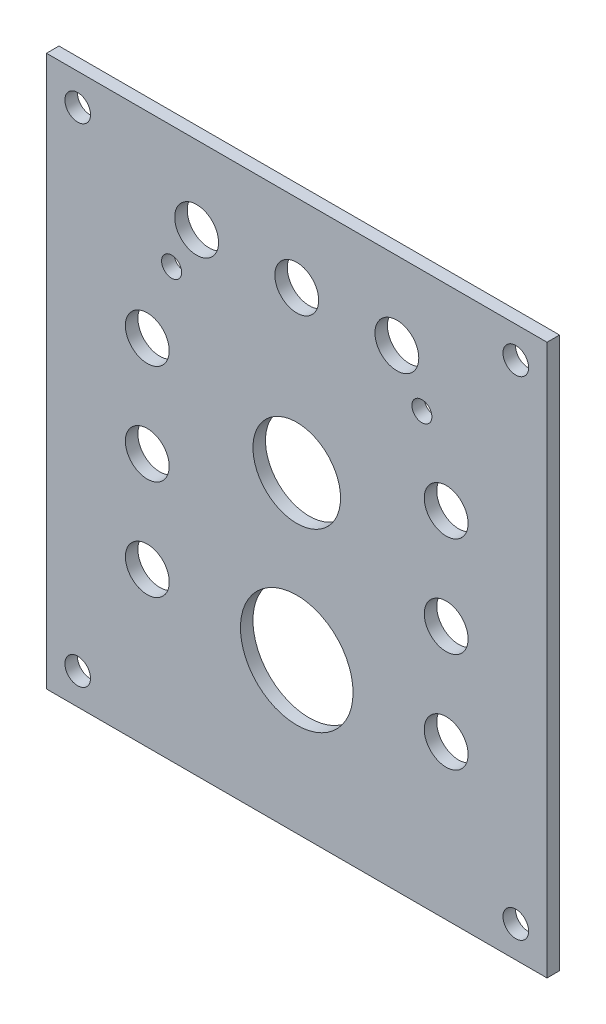
ISO-10303-21;
HEADER;
FILE_DESCRIPTION(('STEP AP214'),'2;1');
FILE_NAME('part.step','',(''),(''),'','','');
FILE_SCHEMA(('AUTOMOTIVE_DESIGN { 1 0 10303 214 1 1 1 1 }'));
ENDSEC;
DATA;
#1=APPLICATION_CONTEXT('core data for automotive mechanical design processes');
#2=APPLICATION_PROTOCOL_DEFINITION('international standard','automotive_design',2000,#1);
#3=PRODUCT_CONTEXT('',#1,'mechanical');
#4=PRODUCT('Part','Part','',(#3));
#5=PRODUCT_RELATED_PRODUCT_CATEGORY('part','',(#4));
#6=PRODUCT_DEFINITION_FORMATION('','',#4);
#7=PRODUCT_DEFINITION_CONTEXT('part definition',#1,'design');
#8=PRODUCT_DEFINITION('design','',#6,#7);
#9=PRODUCT_DEFINITION_SHAPE('','',#8);
#10=(LENGTH_UNIT() NAMED_UNIT(*) SI_UNIT(.MILLI.,.METRE.));
#11=(NAMED_UNIT(*) PLANE_ANGLE_UNIT() SI_UNIT($,.RADIAN.));
#12=(NAMED_UNIT(*) SI_UNIT($,.STERADIAN.) SOLID_ANGLE_UNIT());
#13=UNCERTAINTY_MEASURE_WITH_UNIT(LENGTH_MEASURE(1.E-05),#10,'distance_accuracy_value','');
#14=(GEOMETRIC_REPRESENTATION_CONTEXT(3) GLOBAL_UNCERTAINTY_ASSIGNED_CONTEXT((#13)) GLOBAL_UNIT_ASSIGNED_CONTEXT((#10,
#11,#12)) REPRESENTATION_CONTEXT('',''));
#15=CARTESIAN_POINT('',(0.,0.,0.));
#16=DIRECTION('',(0.,0.,1.));
#17=DIRECTION('',(1.,0.,0.));
#18=AXIS2_PLACEMENT_3D('',#15,#16,#17);
#19=CARTESIAN_POINT('',(63.5,101.6,0.));
#20=DIRECTION('',(1.,0.,0.));
#21=DIRECTION('',(0.,0.,-1.));
#22=AXIS2_PLACEMENT_3D('',#19,#20,#21);
#23=PLANE('',#22);
#24=DIRECTION('',(0.,-1.,0.));
#25=VECTOR('',#24,1.);
#26=CARTESIAN_POINT('',(63.5,101.6,-3.175));
#27=LINE('',#26,#25);
#28=CARTESIAN_POINT('',(63.5,101.6,-3.175));
#29=VERTEX_POINT('',#28);
#30=CARTESIAN_POINT('',(63.5,-38.1,-3.175));
#31=VERTEX_POINT('',#30);
#32=EDGE_CURVE('E98',#29,#31,#27,.T.);
#33=ORIENTED_EDGE('',*,*,#32,.F.);
#34=DIRECTION('',(0.,0.,-1.));
#35=VECTOR('',#34,1.);
#36=CARTESIAN_POINT('',(63.5,101.6,0.));
#37=LINE('',#36,#35);
#38=CARTESIAN_POINT('',(63.5,101.6,0.));
#39=VERTEX_POINT('',#38);
#40=EDGE_CURVE('E11',#39,#29,#37,.T.);
#41=ORIENTED_EDGE('',*,*,#40,.F.);
#42=DIRECTION('',(0.,-1.,0.));
#43=VECTOR('',#42,1.);
#44=CARTESIAN_POINT('',(63.5,101.6,0.));
#45=LINE('',#44,#43);
#46=CARTESIAN_POINT('',(63.5,-38.1,0.));
#47=VERTEX_POINT('',#46);
#48=EDGE_CURVE('E91',#39,#47,#45,.T.);
#49=ORIENTED_EDGE('',*,*,#48,.T.);
#50=DIRECTION('',(0.,0.,-1.));
#51=VECTOR('',#50,1.);
#52=CARTESIAN_POINT('',(63.5,-38.1,0.));
#53=LINE('',#52,#51);
#54=EDGE_CURVE('E36',#47,#31,#53,.T.);
#55=ORIENTED_EDGE('',*,*,#54,.T.);
#56=EDGE_LOOP('',(#33,#41,#49,#55));
#57=FACE_BOUND('',#56,.T.);
#58=ADVANCED_FACE('F33',(#57),#23,.T.);
#59=CARTESIAN_POINT('',(-63.5,101.6,0.));
#60=DIRECTION('',(0.,1.,0.));
#61=DIRECTION('',(0.,0.,1.));
#62=AXIS2_PLACEMENT_3D('',#59,#60,#61);
#63=PLANE('',#62);
#64=DIRECTION('',(1.,0.,0.));
#65=VECTOR('',#64,1.);
#66=CARTESIAN_POINT('',(-63.5,101.6,-3.175));
#67=LINE('',#66,#65);
#68=CARTESIAN_POINT('',(-63.5,101.6,-3.175));
#69=VERTEX_POINT('',#68);
#70=EDGE_CURVE('E93',#69,#29,#67,.T.);
#71=ORIENTED_EDGE('',*,*,#70,.F.);
#72=DIRECTION('',(0.,0.,-1.));
#73=VECTOR('',#72,1.);
#74=CARTESIAN_POINT('',(-63.5,101.6,0.));
#75=LINE('',#74,#73);
#76=CARTESIAN_POINT('',(-63.5,101.6,0.));
#77=VERTEX_POINT('',#76);
#78=EDGE_CURVE('E42',#77,#69,#75,.T.);
#79=ORIENTED_EDGE('',*,*,#78,.F.);
#80=DIRECTION('',(1.,0.,0.));
#81=VECTOR('',#80,1.);
#82=CARTESIAN_POINT('',(-63.5,101.6,0.));
#83=LINE('',#82,#81);
#84=EDGE_CURVE('E88',#77,#39,#83,.T.);
#85=ORIENTED_EDGE('',*,*,#84,.T.);
#86=ORIENTED_EDGE('',*,*,#40,.T.);
#87=EDGE_LOOP('',(#71,#79,#85,#86));
#88=FACE_BOUND('',#87,.T.);
#89=ADVANCED_FACE('F109',(#88),#63,.T.);
#90=CARTESIAN_POINT('',(-63.5,-38.1,0.));
#91=DIRECTION('',(-1.,0.,0.));
#92=DIRECTION('',(0.,0.,1.));
#93=AXIS2_PLACEMENT_3D('',#90,#91,#92);
#94=PLANE('',#93);
#95=DIRECTION('',(0.,1.,0.));
#96=VECTOR('',#95,1.);
#97=CARTESIAN_POINT('',(-63.5,-38.1,-3.175));
#98=LINE('',#97,#96);
#99=CARTESIAN_POINT('',(-63.5,-38.1,-3.175));
#100=VERTEX_POINT('',#99);
#101=EDGE_CURVE('E83',#100,#69,#98,.T.);
#102=ORIENTED_EDGE('',*,*,#101,.F.);
#103=DIRECTION('',(0.,0.,-1.));
#104=VECTOR('',#103,1.);
#105=CARTESIAN_POINT('',(-63.5,-38.1,0.));
#106=LINE('',#105,#104);
#107=CARTESIAN_POINT('',(-63.5,-38.1,0.));
#108=VERTEX_POINT('',#107);
#109=EDGE_CURVE('E78',#108,#100,#106,.T.);
#110=ORIENTED_EDGE('',*,*,#109,.F.);
#111=DIRECTION('',(0.,1.,0.));
#112=VECTOR('',#111,1.);
#113=CARTESIAN_POINT('',(-63.5,-38.1,0.));
#114=LINE('',#113,#112);
#115=EDGE_CURVE('E81',#108,#77,#114,.T.);
#116=ORIENTED_EDGE('',*,*,#115,.T.);
#117=ORIENTED_EDGE('',*,*,#78,.T.);
#118=EDGE_LOOP('',(#102,#110,#116,#117));
#119=FACE_BOUND('',#118,.T.);
#120=ADVANCED_FACE('F80',(#119),#94,.T.);
#121=CARTESIAN_POINT('',(63.5,-38.1,0.));
#122=DIRECTION('',(0.,-1.,0.));
#123=DIRECTION('',(1.,0.,0.));
#124=AXIS2_PLACEMENT_3D('',#121,#122,#123);
#125=PLANE('',#124);
#126=DIRECTION('',(-1.,0.,0.));
#127=VECTOR('',#126,1.);
#128=CARTESIAN_POINT('',(63.5,-38.1,-3.175));
#129=LINE('',#128,#127);
#130=EDGE_CURVE('E101',#31,#100,#129,.T.);
#131=ORIENTED_EDGE('',*,*,#130,.F.);
#132=ORIENTED_EDGE('',*,*,#54,.F.);
#133=DIRECTION('',(-1.,0.,0.));
#134=VECTOR('',#133,1.);
#135=CARTESIAN_POINT('',(63.5,-38.1,0.));
#136=LINE('',#135,#134);
#137=EDGE_CURVE('E87',#47,#108,#136,.T.);
#138=ORIENTED_EDGE('',*,*,#137,.T.);
#139=ORIENTED_EDGE('',*,*,#109,.T.);
#140=EDGE_LOOP('',(#131,#132,#138,#139));
#141=FACE_BOUND('',#140,.T.);
#142=ADVANCED_FACE('F90',(#141),#125,.T.);
#143=CARTESIAN_POINT('',(0.,0.,0.));
#144=DIRECTION('',(0.,0.,-1.));
#145=DIRECTION('',(-1.,0.,0.));
#146=AXIS2_PLACEMENT_3D('',#143,#144,#145);
#147=PLANE('',#146);
#148=CARTESIAN_POINT('',(31.75,70.58025,0.));
#149=DIRECTION('',(0.,0.,-1.));
#150=DIRECTION('',(1.,0.,0.));
#151=AXIS2_PLACEMENT_3D('',#148,#149,#150);
#152=CIRCLE('',#151,2.54);
#153=CARTESIAN_POINT('',(34.29,70.58025,0.));
#154=VERTEX_POINT('',#153);
#155=EDGE_CURVE('E202',#154,#154,#152,.T.);
#156=ORIENTED_EDGE('',*,*,#155,.T.);
#157=EDGE_LOOP('',(#156));
#158=FACE_BOUND('',#157,.T.);
#159=CARTESIAN_POINT('',(-31.75,70.58025,0.));
#160=DIRECTION('',(0.,0.,-1.));
#161=DIRECTION('',(1.,0.,0.));
#162=AXIS2_PLACEMENT_3D('',#159,#160,#161);
#163=CIRCLE('',#162,2.54);
#164=CARTESIAN_POINT('',(-29.21,70.58025,0.));
#165=VERTEX_POINT('',#164);
#166=EDGE_CURVE('E210',#165,#165,#163,.T.);
#167=ORIENTED_EDGE('',*,*,#166,.T.);
#168=EDGE_LOOP('',(#167));
#169=FACE_BOUND('',#168,.T.);
#170=CARTESIAN_POINT('',(37.9152217386642,26.3771785892618,0.));
#171=DIRECTION('',(0.,0.,-1.));
#172=DIRECTION('',(1.,0.,0.));
#173=AXIS2_PLACEMENT_3D('',#170,#171,#172);
#174=CIRCLE('',#173,5.5626);
#175=CARTESIAN_POINT('',(43.4778217386642,26.3771785892618,0.));
#176=VERTEX_POINT('',#175);
#177=EDGE_CURVE('E216',#176,#176,#174,.T.);
#178=ORIENTED_EDGE('',*,*,#177,.T.);
#179=EDGE_LOOP('',(#178));
#180=FACE_BOUND('',#179,.T.);
#181=CARTESIAN_POINT('',(-37.9152217386642,26.3771785892618,0.));
#182=DIRECTION('',(0.,0.,-1.));
#183=DIRECTION('',(1.,0.,0.));
#184=AXIS2_PLACEMENT_3D('',#181,#182,#183);
#185=CIRCLE('',#184,5.5626);
#186=CARTESIAN_POINT('',(-32.3526217386642,26.3771785892618,0.));
#187=VERTEX_POINT('',#186);
#188=EDGE_CURVE('E222',#187,#187,#185,.T.);
#189=ORIENTED_EDGE('',*,*,#188,.T.);
#190=EDGE_LOOP('',(#189));
#191=FACE_BOUND('',#190,.T.);
#192=CARTESIAN_POINT('',(-37.9152217386642,0.977178589261808,0.));
#193=DIRECTION('',(0.,0.,-1.));
#194=DIRECTION('',(1.,0.,0.));
#195=AXIS2_PLACEMENT_3D('',#192,#193,#194);
#196=CIRCLE('',#195,5.5626);
#197=CARTESIAN_POINT('',(-32.3526217386642,0.977178589261808,0.));
#198=VERTEX_POINT('',#197);
#199=EDGE_CURVE('E228',#198,#198,#196,.T.);
#200=ORIENTED_EDGE('',*,*,#199,.T.);
#201=EDGE_LOOP('',(#200));
#202=FACE_BOUND('',#201,.T.);
#203=CARTESIAN_POINT('',(37.9152217386642,51.7771785892618,0.));
#204=DIRECTION('',(0.,0.,-1.));
#205=DIRECTION('',(1.,0.,0.));
#206=AXIS2_PLACEMENT_3D('',#203,#204,#205);
#207=CIRCLE('',#206,5.56260000000001);
#208=CARTESIAN_POINT('',(43.4778217386643,51.7771785892618,0.));
#209=VERTEX_POINT('',#208);
#210=EDGE_CURVE('E234',#209,#209,#207,.T.);
#211=ORIENTED_EDGE('',*,*,#210,.T.);
#212=EDGE_LOOP('',(#211));
#213=FACE_BOUND('',#212,.T.);
#214=CARTESIAN_POINT('',(-25.4,81.8388,0.));
#215=DIRECTION('',(0.,0.,-1.));
#216=DIRECTION('',(1.,0.,0.));
#217=AXIS2_PLACEMENT_3D('',#214,#215,#216);
#218=CIRCLE('',#217,5.5626);
#219=CARTESIAN_POINT('',(-19.8374,81.8388,0.));
#220=VERTEX_POINT('',#219);
#221=EDGE_CURVE('E240',#220,#220,#218,.T.);
#222=ORIENTED_EDGE('',*,*,#221,.T.);
#223=EDGE_LOOP('',(#222));
#224=FACE_BOUND('',#223,.T.);
#225=CARTESIAN_POINT('',(0.,0.,0.));
#226=DIRECTION('',(0.,0.,-1.));
#227=DIRECTION('',(1.,0.,0.));
#228=AXIS2_PLACEMENT_3D('',#225,#226,#227);
#229=CIRCLE('',#228,14.2875);
#230=CARTESIAN_POINT('',(14.2875,0.,0.));
#231=VERTEX_POINT('',#230);
#232=EDGE_CURVE('E246',#231,#231,#229,.T.);
#233=ORIENTED_EDGE('',*,*,#232,.T.);
#234=EDGE_LOOP('',(#233));
#235=FACE_BOUND('',#234,.T.);
#236=CARTESIAN_POINT('',(-55.5752,93.6752,0.));
#237=DIRECTION('',(0.,0.,-1.));
#238=DIRECTION('',(1.,0.,0.));
#239=AXIS2_PLACEMENT_3D('',#236,#237,#238);
#240=CIRCLE('',#239,3.2512);
#241=CARTESIAN_POINT('',(-52.324,93.6752,0.));
#242=VERTEX_POINT('',#241);
#243=EDGE_CURVE('E252',#242,#242,#240,.T.);
#244=ORIENTED_EDGE('',*,*,#243,.T.);
#245=EDGE_LOOP('',(#244));
#246=FACE_BOUND('',#245,.T.);
#247=CARTESIAN_POINT('',(55.5752,-30.1752,0.));
#248=DIRECTION('',(0.,0.,-1.));
#249=DIRECTION('',(1.,0.,0.));
#250=AXIS2_PLACEMENT_3D('',#247,#248,#249);
#251=CIRCLE('',#250,3.2512);
#252=CARTESIAN_POINT('',(58.8264,-30.1752,0.));
#253=VERTEX_POINT('',#252);
#254=EDGE_CURVE('E258',#253,#253,#251,.T.);
#255=ORIENTED_EDGE('',*,*,#254,.T.);
#256=EDGE_LOOP('',(#255));
#257=FACE_BOUND('',#256,.T.);
#258=CARTESIAN_POINT('',(55.5752,93.6752,0.));
#259=DIRECTION('',(0.,0.,-1.));
#260=DIRECTION('',(1.,0.,0.));
#261=AXIS2_PLACEMENT_3D('',#258,#259,#260);
#262=CIRCLE('',#261,3.25119999999999);
#263=CARTESIAN_POINT('',(58.8264,93.6752,0.));
#264=VERTEX_POINT('',#263);
#265=EDGE_CURVE('E264',#264,#264,#262,.T.);
#266=ORIENTED_EDGE('',*,*,#265,.T.);
#267=EDGE_LOOP('',(#266));
#268=FACE_BOUND('',#267,.T.);
#269=CARTESIAN_POINT('',(0.,41.148,0.));
#270=DIRECTION('',(0.,0.,-1.));
#271=DIRECTION('',(1.,0.,0.));
#272=AXIS2_PLACEMENT_3D('',#269,#270,#271);
#273=CIRCLE('',#272,11.1125);
#274=CARTESIAN_POINT('',(11.1125,41.148,0.));
#275=VERTEX_POINT('',#274);
#276=EDGE_CURVE('E270',#275,#275,#273,.T.);
#277=ORIENTED_EDGE('',*,*,#276,.T.);
#278=EDGE_LOOP('',(#277));
#279=FACE_BOUND('',#278,.T.);
#280=CARTESIAN_POINT('',(25.4,81.8388,0.));
#281=DIRECTION('',(0.,0.,-1.));
#282=DIRECTION('',(1.,0.,0.));
#283=AXIS2_PLACEMENT_3D('',#280,#281,#282);
#284=CIRCLE('',#283,5.5626);
#285=CARTESIAN_POINT('',(30.9626,81.8388,0.));
#286=VERTEX_POINT('',#285);
#287=EDGE_CURVE('E276',#286,#286,#284,.T.);
#288=ORIENTED_EDGE('',*,*,#287,.T.);
#289=EDGE_LOOP('',(#288));
#290=FACE_BOUND('',#289,.T.);
#291=CARTESIAN_POINT('',(37.9152217386642,0.977178589261784,0.));
#292=DIRECTION('',(0.,0.,-1.));
#293=DIRECTION('',(1.,0.,0.));
#294=AXIS2_PLACEMENT_3D('',#291,#292,#293);
#295=CIRCLE('',#294,5.5626);
#296=CARTESIAN_POINT('',(43.4778217386642,0.977178589261784,0.));
#297=VERTEX_POINT('',#296);
#298=EDGE_CURVE('E282',#297,#297,#295,.T.);
#299=ORIENTED_EDGE('',*,*,#298,.T.);
#300=EDGE_LOOP('',(#299));
#301=FACE_BOUND('',#300,.T.);
#302=CARTESIAN_POINT('',(-37.9152217386642,51.7771785892618,0.));
#303=DIRECTION('',(0.,0.,-1.));
#304=DIRECTION('',(1.,0.,0.));
#305=AXIS2_PLACEMENT_3D('',#302,#303,#304);
#306=CIRCLE('',#305,5.5626);
#307=CARTESIAN_POINT('',(-32.3526217386642,51.7771785892618,0.));
#308=VERTEX_POINT('',#307);
#309=EDGE_CURVE('E288',#308,#308,#306,.T.);
#310=ORIENTED_EDGE('',*,*,#309,.T.);
#311=EDGE_LOOP('',(#310));
#312=FACE_BOUND('',#311,.T.);
#313=CARTESIAN_POINT('',(0.,81.8388,0.));
#314=DIRECTION('',(0.,0.,-1.));
#315=DIRECTION('',(1.,0.,0.));
#316=AXIS2_PLACEMENT_3D('',#313,#314,#315);
#317=CIRCLE('',#316,5.5626);
#318=CARTESIAN_POINT('',(5.5626,81.8388,0.));
#319=VERTEX_POINT('',#318);
#320=EDGE_CURVE('E294',#319,#319,#317,.T.);
#321=ORIENTED_EDGE('',*,*,#320,.T.);
#322=EDGE_LOOP('',(#321));
#323=FACE_BOUND('',#322,.T.);
#324=CARTESIAN_POINT('',(-55.5752000000001,-30.1752,0.));
#325=DIRECTION('',(0.,0.,-1.));
#326=DIRECTION('',(1.,0.,0.));
#327=AXIS2_PLACEMENT_3D('',#324,#325,#326);
#328=CIRCLE('',#327,3.2512);
#329=CARTESIAN_POINT('',(-52.3240000000001,-30.1752,0.));
#330=VERTEX_POINT('',#329);
#331=EDGE_CURVE('E102',#330,#330,#328,.T.);
#332=ORIENTED_EDGE('',*,*,#331,.T.);
#333=EDGE_LOOP('',(#332));
#334=FACE_BOUND('',#333,.T.);
#335=ORIENTED_EDGE('',*,*,#48,.F.);
#336=ORIENTED_EDGE('',*,*,#84,.F.);
#337=ORIENTED_EDGE('',*,*,#115,.F.);
#338=ORIENTED_EDGE('',*,*,#137,.F.);
#339=EDGE_LOOP('',(#335,#336,#337,#338));
#340=FACE_BOUND('',#339,.T.);
#341=ADVANCED_FACE('F86',(#158,#169,#180,#191,#202,#213,#224,#235,#246,#257,#268,#279,#290,#301,
#312,#323,#334,#340),#147,.F.);
#342=CARTESIAN_POINT('',(0.,0.,-3.175));
#343=DIRECTION('',(0.,0.,-1.));
#344=DIRECTION('',(-1.,0.,0.));
#345=AXIS2_PLACEMENT_3D('',#342,#343,#344);
#346=PLANE('',#345);
#347=CARTESIAN_POINT('',(31.75,70.58025,-3.175));
#348=DIRECTION('',(0.,0.,-1.));
#349=DIRECTION('',(1.,0.,0.));
#350=AXIS2_PLACEMENT_3D('',#347,#348,#349);
#351=CIRCLE('',#350,2.54);
#352=CARTESIAN_POINT('',(34.29,70.58025,-3.175));
#353=VERTEX_POINT('',#352);
#354=EDGE_CURVE('E205',#353,#353,#351,.T.);
#355=ORIENTED_EDGE('',*,*,#354,.F.);
#356=EDGE_LOOP('',(#355));
#357=FACE_BOUND('',#356,.T.);
#358=CARTESIAN_POINT('',(-31.75,70.58025,-3.175));
#359=DIRECTION('',(0.,0.,-1.));
#360=DIRECTION('',(1.,0.,0.));
#361=AXIS2_PLACEMENT_3D('',#358,#359,#360);
#362=CIRCLE('',#361,2.54);
#363=CARTESIAN_POINT('',(-29.21,70.58025,-3.175));
#364=VERTEX_POINT('',#363);
#365=EDGE_CURVE('E207',#364,#364,#362,.T.);
#366=ORIENTED_EDGE('',*,*,#365,.F.);
#367=EDGE_LOOP('',(#366));
#368=FACE_BOUND('',#367,.T.);
#369=CARTESIAN_POINT('',(37.9152217386642,26.3771785892618,-3.175));
#370=DIRECTION('',(0.,0.,-1.));
#371=DIRECTION('',(1.,0.,0.));
#372=AXIS2_PLACEMENT_3D('',#369,#370,#371);
#373=CIRCLE('',#372,5.5626);
#374=CARTESIAN_POINT('',(43.4778217386642,26.3771785892618,-3.175));
#375=VERTEX_POINT('',#374);
#376=EDGE_CURVE('E213',#375,#375,#373,.T.);
#377=ORIENTED_EDGE('',*,*,#376,.F.);
#378=EDGE_LOOP('',(#377));
#379=FACE_BOUND('',#378,.T.);
#380=CARTESIAN_POINT('',(-37.9152217386642,26.3771785892618,-3.175));
#381=DIRECTION('',(0.,0.,-1.));
#382=DIRECTION('',(1.,0.,0.));
#383=AXIS2_PLACEMENT_3D('',#380,#381,#382);
#384=CIRCLE('',#383,5.5626);
#385=CARTESIAN_POINT('',(-32.3526217386642,26.3771785892618,-3.175));
#386=VERTEX_POINT('',#385);
#387=EDGE_CURVE('E219',#386,#386,#384,.T.);
#388=ORIENTED_EDGE('',*,*,#387,.F.);
#389=EDGE_LOOP('',(#388));
#390=FACE_BOUND('',#389,.T.);
#391=CARTESIAN_POINT('',(-37.9152217386642,0.977178589261808,-3.175));
#392=DIRECTION('',(0.,0.,-1.));
#393=DIRECTION('',(1.,0.,0.));
#394=AXIS2_PLACEMENT_3D('',#391,#392,#393);
#395=CIRCLE('',#394,5.5626);
#396=CARTESIAN_POINT('',(-32.3526217386642,0.977178589261808,-3.175));
#397=VERTEX_POINT('',#396);
#398=EDGE_CURVE('E225',#397,#397,#395,.T.);
#399=ORIENTED_EDGE('',*,*,#398,.F.);
#400=EDGE_LOOP('',(#399));
#401=FACE_BOUND('',#400,.T.);
#402=CARTESIAN_POINT('',(37.9152217386642,51.7771785892618,-3.175));
#403=DIRECTION('',(0.,0.,-1.));
#404=DIRECTION('',(1.,0.,0.));
#405=AXIS2_PLACEMENT_3D('',#402,#403,#404);
#406=CIRCLE('',#405,5.56260000000001);
#407=CARTESIAN_POINT('',(43.4778217386643,51.7771785892618,-3.175));
#408=VERTEX_POINT('',#407);
#409=EDGE_CURVE('E231',#408,#408,#406,.T.);
#410=ORIENTED_EDGE('',*,*,#409,.F.);
#411=EDGE_LOOP('',(#410));
#412=FACE_BOUND('',#411,.T.);
#413=CARTESIAN_POINT('',(-25.4,81.8388,-3.175));
#414=DIRECTION('',(0.,0.,-1.));
#415=DIRECTION('',(1.,0.,0.));
#416=AXIS2_PLACEMENT_3D('',#413,#414,#415);
#417=CIRCLE('',#416,5.5626);
#418=CARTESIAN_POINT('',(-19.8374,81.8388,-3.175));
#419=VERTEX_POINT('',#418);
#420=EDGE_CURVE('E237',#419,#419,#417,.T.);
#421=ORIENTED_EDGE('',*,*,#420,.F.);
#422=EDGE_LOOP('',(#421));
#423=FACE_BOUND('',#422,.T.);
#424=CARTESIAN_POINT('',(0.,0.,-3.175));
#425=DIRECTION('',(0.,0.,-1.));
#426=DIRECTION('',(1.,0.,0.));
#427=AXIS2_PLACEMENT_3D('',#424,#425,#426);
#428=CIRCLE('',#427,14.2875);
#429=CARTESIAN_POINT('',(14.2875,0.,-3.175));
#430=VERTEX_POINT('',#429);
#431=EDGE_CURVE('E243',#430,#430,#428,.T.);
#432=ORIENTED_EDGE('',*,*,#431,.F.);
#433=EDGE_LOOP('',(#432));
#434=FACE_BOUND('',#433,.T.);
#435=CARTESIAN_POINT('',(-55.5752,93.6752,-3.175));
#436=DIRECTION('',(0.,0.,-1.));
#437=DIRECTION('',(1.,0.,0.));
#438=AXIS2_PLACEMENT_3D('',#435,#436,#437);
#439=CIRCLE('',#438,3.2512);
#440=CARTESIAN_POINT('',(-52.324,93.6752,-3.175));
#441=VERTEX_POINT('',#440);
#442=EDGE_CURVE('E249',#441,#441,#439,.T.);
#443=ORIENTED_EDGE('',*,*,#442,.F.);
#444=EDGE_LOOP('',(#443));
#445=FACE_BOUND('',#444,.T.);
#446=CARTESIAN_POINT('',(55.5752,-30.1752,-3.175));
#447=DIRECTION('',(0.,0.,-1.));
#448=DIRECTION('',(1.,0.,0.));
#449=AXIS2_PLACEMENT_3D('',#446,#447,#448);
#450=CIRCLE('',#449,3.2512);
#451=CARTESIAN_POINT('',(58.8264,-30.1752,-3.175));
#452=VERTEX_POINT('',#451);
#453=EDGE_CURVE('E255',#452,#452,#450,.T.);
#454=ORIENTED_EDGE('',*,*,#453,.F.);
#455=EDGE_LOOP('',(#454));
#456=FACE_BOUND('',#455,.T.);
#457=CARTESIAN_POINT('',(55.5752,93.6752,-3.175));
#458=DIRECTION('',(0.,0.,-1.));
#459=DIRECTION('',(1.,0.,0.));
#460=AXIS2_PLACEMENT_3D('',#457,#458,#459);
#461=CIRCLE('',#460,3.25119999999999);
#462=CARTESIAN_POINT('',(58.8264,93.6752,-3.175));
#463=VERTEX_POINT('',#462);
#464=EDGE_CURVE('E261',#463,#463,#461,.T.);
#465=ORIENTED_EDGE('',*,*,#464,.F.);
#466=EDGE_LOOP('',(#465));
#467=FACE_BOUND('',#466,.T.);
#468=CARTESIAN_POINT('',(0.,41.148,-3.175));
#469=DIRECTION('',(0.,0.,-1.));
#470=DIRECTION('',(1.,0.,0.));
#471=AXIS2_PLACEMENT_3D('',#468,#469,#470);
#472=CIRCLE('',#471,11.1125);
#473=CARTESIAN_POINT('',(11.1125,41.148,-3.175));
#474=VERTEX_POINT('',#473);
#475=EDGE_CURVE('E267',#474,#474,#472,.T.);
#476=ORIENTED_EDGE('',*,*,#475,.F.);
#477=EDGE_LOOP('',(#476));
#478=FACE_BOUND('',#477,.T.);
#479=CARTESIAN_POINT('',(25.4,81.8388,-3.175));
#480=DIRECTION('',(0.,0.,-1.));
#481=DIRECTION('',(1.,0.,0.));
#482=AXIS2_PLACEMENT_3D('',#479,#480,#481);
#483=CIRCLE('',#482,5.5626);
#484=CARTESIAN_POINT('',(30.9626,81.8388,-3.175));
#485=VERTEX_POINT('',#484);
#486=EDGE_CURVE('E273',#485,#485,#483,.T.);
#487=ORIENTED_EDGE('',*,*,#486,.F.);
#488=EDGE_LOOP('',(#487));
#489=FACE_BOUND('',#488,.T.);
#490=CARTESIAN_POINT('',(37.9152217386642,0.977178589261784,-3.175));
#491=DIRECTION('',(0.,0.,-1.));
#492=DIRECTION('',(1.,0.,0.));
#493=AXIS2_PLACEMENT_3D('',#490,#491,#492);
#494=CIRCLE('',#493,5.5626);
#495=CARTESIAN_POINT('',(43.4778217386642,0.977178589261784,-3.175));
#496=VERTEX_POINT('',#495);
#497=EDGE_CURVE('E279',#496,#496,#494,.T.);
#498=ORIENTED_EDGE('',*,*,#497,.F.);
#499=EDGE_LOOP('',(#498));
#500=FACE_BOUND('',#499,.T.);
#501=CARTESIAN_POINT('',(-37.9152217386642,51.7771785892618,-3.175));
#502=DIRECTION('',(0.,0.,-1.));
#503=DIRECTION('',(1.,0.,0.));
#504=AXIS2_PLACEMENT_3D('',#501,#502,#503);
#505=CIRCLE('',#504,5.5626);
#506=CARTESIAN_POINT('',(-32.3526217386642,51.7771785892618,-3.175));
#507=VERTEX_POINT('',#506);
#508=EDGE_CURVE('E285',#507,#507,#505,.T.);
#509=ORIENTED_EDGE('',*,*,#508,.F.);
#510=EDGE_LOOP('',(#509));
#511=FACE_BOUND('',#510,.T.);
#512=CARTESIAN_POINT('',(0.,81.8388,-3.175));
#513=DIRECTION('',(0.,0.,-1.));
#514=DIRECTION('',(1.,0.,0.));
#515=AXIS2_PLACEMENT_3D('',#512,#513,#514);
#516=CIRCLE('',#515,5.5626);
#517=CARTESIAN_POINT('',(5.5626,81.8388,-3.175));
#518=VERTEX_POINT('',#517);
#519=EDGE_CURVE('E291',#518,#518,#516,.T.);
#520=ORIENTED_EDGE('',*,*,#519,.F.);
#521=EDGE_LOOP('',(#520));
#522=FACE_BOUND('',#521,.T.);
#523=CARTESIAN_POINT('',(-55.5752000000001,-30.1752,-3.175));
#524=DIRECTION('',(0.,0.,-1.));
#525=DIRECTION('',(1.,0.,0.));
#526=AXIS2_PLACEMENT_3D('',#523,#524,#525);
#527=CIRCLE('',#526,3.2512);
#528=CARTESIAN_POINT('',(-52.3240000000001,-30.1752,-3.175));
#529=VERTEX_POINT('',#528);
#530=EDGE_CURVE('E297',#529,#529,#527,.T.);
#531=ORIENTED_EDGE('',*,*,#530,.F.);
#532=EDGE_LOOP('',(#531));
#533=FACE_BOUND('',#532,.T.);
#534=ORIENTED_EDGE('',*,*,#32,.T.);
#535=ORIENTED_EDGE('',*,*,#130,.T.);
#536=ORIENTED_EDGE('',*,*,#101,.T.);
#537=ORIENTED_EDGE('',*,*,#70,.T.);
#538=EDGE_LOOP('',(#534,#535,#536,#537));
#539=FACE_BOUND('',#538,.T.);
#540=ADVANCED_FACE('F108',(#357,#368,#379,#390,#401,#412,#423,#434,#445,#456,#467,#478,#489,
#500,#511,#522,#533,#539),#346,.T.);
#541=CARTESIAN_POINT('',(-55.5752000000001,-30.1752,0.));
#542=DIRECTION('',(0.,0.,-1.));
#543=DIRECTION('',(-1.,0.,0.));
#544=AXIS2_PLACEMENT_3D('',#541,#542,#543);
#545=CYLINDRICAL_SURFACE('',#544,3.2512);
#546=ORIENTED_EDGE('',*,*,#331,.F.);
#547=EDGE_LOOP('',(#546));
#548=FACE_BOUND('',#547,.T.);
#549=ORIENTED_EDGE('',*,*,#530,.T.);
#550=EDGE_LOOP('',(#549));
#551=FACE_BOUND('',#550,.T.);
#552=ADVANCED_FACE('F127',(#548,#551),#545,.F.);
#553=CARTESIAN_POINT('',(0.,81.8388,0.));
#554=DIRECTION('',(0.,0.,-1.));
#555=DIRECTION('',(-1.,0.,0.));
#556=AXIS2_PLACEMENT_3D('',#553,#554,#555);
#557=CYLINDRICAL_SURFACE('',#556,5.5626);
#558=ORIENTED_EDGE('',*,*,#320,.F.);
#559=EDGE_LOOP('',(#558));
#560=FACE_BOUND('',#559,.T.);
#561=ORIENTED_EDGE('',*,*,#519,.T.);
#562=EDGE_LOOP('',(#561));
#563=FACE_BOUND('',#562,.T.);
#564=ADVANCED_FACE('F134',(#560,#563),#557,.F.);
#565=CARTESIAN_POINT('',(-37.9152217386642,51.7771785892618,0.));
#566=DIRECTION('',(0.,0.,-1.));
#567=DIRECTION('',(-1.,0.,0.));
#568=AXIS2_PLACEMENT_3D('',#565,#566,#567);
#569=CYLINDRICAL_SURFACE('',#568,5.5626);
#570=ORIENTED_EDGE('',*,*,#309,.F.);
#571=EDGE_LOOP('',(#570));
#572=FACE_BOUND('',#571,.T.);
#573=ORIENTED_EDGE('',*,*,#508,.T.);
#574=EDGE_LOOP('',(#573));
#575=FACE_BOUND('',#574,.T.);
#576=ADVANCED_FACE('F138',(#572,#575),#569,.F.);
#577=CARTESIAN_POINT('',(37.9152217386642,0.977178589261784,0.));
#578=DIRECTION('',(0.,0.,-1.));
#579=DIRECTION('',(-1.,0.,0.));
#580=AXIS2_PLACEMENT_3D('',#577,#578,#579);
#581=CYLINDRICAL_SURFACE('',#580,5.5626);
#582=ORIENTED_EDGE('',*,*,#298,.F.);
#583=EDGE_LOOP('',(#582));
#584=FACE_BOUND('',#583,.T.);
#585=ORIENTED_EDGE('',*,*,#497,.T.);
#586=EDGE_LOOP('',(#585));
#587=FACE_BOUND('',#586,.T.);
#588=ADVANCED_FACE('F142',(#584,#587),#581,.F.);
#589=CARTESIAN_POINT('',(25.4,81.8388,0.));
#590=DIRECTION('',(0.,0.,-1.));
#591=DIRECTION('',(-1.,0.,0.));
#592=AXIS2_PLACEMENT_3D('',#589,#590,#591);
#593=CYLINDRICAL_SURFACE('',#592,5.5626);
#594=ORIENTED_EDGE('',*,*,#287,.F.);
#595=EDGE_LOOP('',(#594));
#596=FACE_BOUND('',#595,.T.);
#597=ORIENTED_EDGE('',*,*,#486,.T.);
#598=EDGE_LOOP('',(#597));
#599=FACE_BOUND('',#598,.T.);
#600=ADVANCED_FACE('F146',(#596,#599),#593,.F.);
#601=CARTESIAN_POINT('',(0.,41.148,0.));
#602=DIRECTION('',(0.,0.,-1.));
#603=DIRECTION('',(-1.,0.,0.));
#604=AXIS2_PLACEMENT_3D('',#601,#602,#603);
#605=CYLINDRICAL_SURFACE('',#604,11.1125);
#606=ORIENTED_EDGE('',*,*,#276,.F.);
#607=EDGE_LOOP('',(#606));
#608=FACE_BOUND('',#607,.T.);
#609=ORIENTED_EDGE('',*,*,#475,.T.);
#610=EDGE_LOOP('',(#609));
#611=FACE_BOUND('',#610,.T.);
#612=ADVANCED_FACE('F150',(#608,#611),#605,.F.);
#613=CARTESIAN_POINT('',(55.5752,93.6752,0.));
#614=DIRECTION('',(0.,0.,-1.));
#615=DIRECTION('',(-1.,0.,0.));
#616=AXIS2_PLACEMENT_3D('',#613,#614,#615);
#617=CYLINDRICAL_SURFACE('',#616,3.25119999999999);
#618=ORIENTED_EDGE('',*,*,#265,.F.);
#619=EDGE_LOOP('',(#618));
#620=FACE_BOUND('',#619,.T.);
#621=ORIENTED_EDGE('',*,*,#464,.T.);
#622=EDGE_LOOP('',(#621));
#623=FACE_BOUND('',#622,.T.);
#624=ADVANCED_FACE('F154',(#620,#623),#617,.F.);
#625=CARTESIAN_POINT('',(55.5752,-30.1752,0.));
#626=DIRECTION('',(0.,0.,-1.));
#627=DIRECTION('',(-1.,0.,0.));
#628=AXIS2_PLACEMENT_3D('',#625,#626,#627);
#629=CYLINDRICAL_SURFACE('',#628,3.2512);
#630=ORIENTED_EDGE('',*,*,#254,.F.);
#631=EDGE_LOOP('',(#630));
#632=FACE_BOUND('',#631,.T.);
#633=ORIENTED_EDGE('',*,*,#453,.T.);
#634=EDGE_LOOP('',(#633));
#635=FACE_BOUND('',#634,.T.);
#636=ADVANCED_FACE('F158',(#632,#635),#629,.F.);
#637=CARTESIAN_POINT('',(-55.5752,93.6752,0.));
#638=DIRECTION('',(0.,0.,-1.));
#639=DIRECTION('',(-1.,0.,0.));
#640=AXIS2_PLACEMENT_3D('',#637,#638,#639);
#641=CYLINDRICAL_SURFACE('',#640,3.2512);
#642=ORIENTED_EDGE('',*,*,#243,.F.);
#643=EDGE_LOOP('',(#642));
#644=FACE_BOUND('',#643,.T.);
#645=ORIENTED_EDGE('',*,*,#442,.T.);
#646=EDGE_LOOP('',(#645));
#647=FACE_BOUND('',#646,.T.);
#648=ADVANCED_FACE('F162',(#644,#647),#641,.F.);
#649=CARTESIAN_POINT('',(0.,0.,0.));
#650=DIRECTION('',(0.,0.,-1.));
#651=DIRECTION('',(-1.,0.,0.));
#652=AXIS2_PLACEMENT_3D('',#649,#650,#651);
#653=CYLINDRICAL_SURFACE('',#652,14.2875);
#654=ORIENTED_EDGE('',*,*,#232,.F.);
#655=EDGE_LOOP('',(#654));
#656=FACE_BOUND('',#655,.T.);
#657=ORIENTED_EDGE('',*,*,#431,.T.);
#658=EDGE_LOOP('',(#657));
#659=FACE_BOUND('',#658,.T.);
#660=ADVANCED_FACE('F166',(#656,#659),#653,.F.);
#661=CARTESIAN_POINT('',(-25.4,81.8388,0.));
#662=DIRECTION('',(0.,0.,-1.));
#663=DIRECTION('',(-1.,0.,0.));
#664=AXIS2_PLACEMENT_3D('',#661,#662,#663);
#665=CYLINDRICAL_SURFACE('',#664,5.5626);
#666=ORIENTED_EDGE('',*,*,#221,.F.);
#667=EDGE_LOOP('',(#666));
#668=FACE_BOUND('',#667,.T.);
#669=ORIENTED_EDGE('',*,*,#420,.T.);
#670=EDGE_LOOP('',(#669));
#671=FACE_BOUND('',#670,.T.);
#672=ADVANCED_FACE('F170',(#668,#671),#665,.F.);
#673=CARTESIAN_POINT('',(37.9152217386642,51.7771785892618,0.));
#674=DIRECTION('',(0.,0.,-1.));
#675=DIRECTION('',(-1.,0.,0.));
#676=AXIS2_PLACEMENT_3D('',#673,#674,#675);
#677=CYLINDRICAL_SURFACE('',#676,5.56260000000001);
#678=ORIENTED_EDGE('',*,*,#210,.F.);
#679=EDGE_LOOP('',(#678));
#680=FACE_BOUND('',#679,.T.);
#681=ORIENTED_EDGE('',*,*,#409,.T.);
#682=EDGE_LOOP('',(#681));
#683=FACE_BOUND('',#682,.T.);
#684=ADVANCED_FACE('F174',(#680,#683),#677,.F.);
#685=CARTESIAN_POINT('',(-37.9152217386642,0.977178589261808,0.));
#686=DIRECTION('',(0.,0.,-1.));
#687=DIRECTION('',(-1.,0.,0.));
#688=AXIS2_PLACEMENT_3D('',#685,#686,#687);
#689=CYLINDRICAL_SURFACE('',#688,5.5626);
#690=ORIENTED_EDGE('',*,*,#199,.F.);
#691=EDGE_LOOP('',(#690));
#692=FACE_BOUND('',#691,.T.);
#693=ORIENTED_EDGE('',*,*,#398,.T.);
#694=EDGE_LOOP('',(#693));
#695=FACE_BOUND('',#694,.T.);
#696=ADVANCED_FACE('F178',(#692,#695),#689,.F.);
#697=CARTESIAN_POINT('',(-37.9152217386642,26.3771785892618,0.));
#698=DIRECTION('',(0.,0.,-1.));
#699=DIRECTION('',(-1.,0.,0.));
#700=AXIS2_PLACEMENT_3D('',#697,#698,#699);
#701=CYLINDRICAL_SURFACE('',#700,5.5626);
#702=ORIENTED_EDGE('',*,*,#188,.F.);
#703=EDGE_LOOP('',(#702));
#704=FACE_BOUND('',#703,.T.);
#705=ORIENTED_EDGE('',*,*,#387,.T.);
#706=EDGE_LOOP('',(#705));
#707=FACE_BOUND('',#706,.T.);
#708=ADVANCED_FACE('F182',(#704,#707),#701,.F.);
#709=CARTESIAN_POINT('',(37.9152217386642,26.3771785892618,0.));
#710=DIRECTION('',(0.,0.,-1.));
#711=DIRECTION('',(-1.,0.,0.));
#712=AXIS2_PLACEMENT_3D('',#709,#710,#711);
#713=CYLINDRICAL_SURFACE('',#712,5.5626);
#714=ORIENTED_EDGE('',*,*,#177,.F.);
#715=EDGE_LOOP('',(#714));
#716=FACE_BOUND('',#715,.T.);
#717=ORIENTED_EDGE('',*,*,#376,.T.);
#718=EDGE_LOOP('',(#717));
#719=FACE_BOUND('',#718,.T.);
#720=ADVANCED_FACE('F186',(#716,#719),#713,.F.);
#721=CARTESIAN_POINT('',(-31.75,70.58025,0.));
#722=DIRECTION('',(0.,0.,-1.));
#723=DIRECTION('',(-1.,0.,0.));
#724=AXIS2_PLACEMENT_3D('',#721,#722,#723);
#725=CYLINDRICAL_SURFACE('',#724,2.54);
#726=ORIENTED_EDGE('',*,*,#166,.F.);
#727=EDGE_LOOP('',(#726));
#728=FACE_BOUND('',#727,.T.);
#729=ORIENTED_EDGE('',*,*,#365,.T.);
#730=EDGE_LOOP('',(#729));
#731=FACE_BOUND('',#730,.T.);
#732=ADVANCED_FACE('F190',(#728,#731),#725,.F.);
#733=CARTESIAN_POINT('',(31.75,70.58025,0.));
#734=DIRECTION('',(0.,0.,-1.));
#735=DIRECTION('',(-1.,0.,0.));
#736=AXIS2_PLACEMENT_3D('',#733,#734,#735);
#737=CYLINDRICAL_SURFACE('',#736,2.54);
#738=ORIENTED_EDGE('',*,*,#155,.F.);
#739=EDGE_LOOP('',(#738));
#740=FACE_BOUND('',#739,.T.);
#741=ORIENTED_EDGE('',*,*,#354,.T.);
#742=EDGE_LOOP('',(#741));
#743=FACE_BOUND('',#742,.T.);
#744=ADVANCED_FACE('F194',(#740,#743),#737,.F.);
#745=CLOSED_SHELL('',(#58,#89,#120,#142,#341,#540,#552,#564,#576,#588,#600,#612,#624,#636,#648,
#660,#672,#684,#696,#708,#720,#732,#744));
#746=MANIFOLD_SOLID_BREP('B2',#745);
#747=ADVANCED_BREP_SHAPE_REPRESENTATION('',(#18,#746),#14);
#748=SHAPE_DEFINITION_REPRESENTATION(#9,#747);
ENDSEC;
END-ISO-10303-21;
